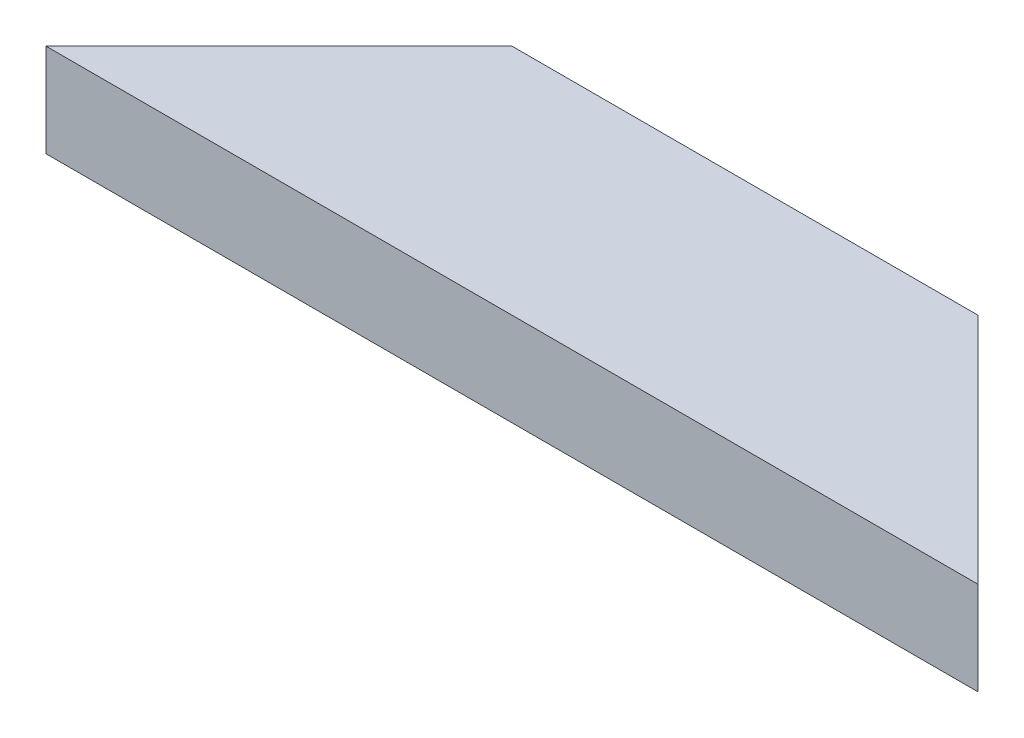
ISO-10303-21;
HEADER;
FILE_DESCRIPTION(('STEP AP214'),'2;1');
FILE_NAME('part.step','',(''),(''),'','','');
FILE_SCHEMA(('AUTOMOTIVE_DESIGN { 1 0 10303 214 1 1 1 1 }'));
ENDSEC;
DATA;
#1=APPLICATION_CONTEXT('core data for automotive mechanical design processes');
#2=APPLICATION_PROTOCOL_DEFINITION('international standard','automotive_design',2000,#1);
#3=PRODUCT_CONTEXT('',#1,'mechanical');
#4=PRODUCT('Part','Part','',(#3));
#5=PRODUCT_RELATED_PRODUCT_CATEGORY('part','',(#4));
#6=PRODUCT_DEFINITION_FORMATION('','',#4);
#7=PRODUCT_DEFINITION_CONTEXT('part definition',#1,'design');
#8=PRODUCT_DEFINITION('design','',#6,#7);
#9=PRODUCT_DEFINITION_SHAPE('','',#8);
#10=(LENGTH_UNIT() NAMED_UNIT(*) SI_UNIT(.MILLI.,.METRE.));
#11=(NAMED_UNIT(*) PLANE_ANGLE_UNIT() SI_UNIT($,.RADIAN.));
#12=(NAMED_UNIT(*) SI_UNIT($,.STERADIAN.) SOLID_ANGLE_UNIT());
#13=UNCERTAINTY_MEASURE_WITH_UNIT(LENGTH_MEASURE(1.E-05),#10,'distance_accuracy_value','');
#14=(GEOMETRIC_REPRESENTATION_CONTEXT(3) GLOBAL_UNCERTAINTY_ASSIGNED_CONTEXT((#13)) GLOBAL_UNIT_ASSIGNED_CONTEXT((#10,
#11,#12)) REPRESENTATION_CONTEXT('',''));
#15=CARTESIAN_POINT('',(0.,0.,0.));
#16=DIRECTION('',(0.,0.,1.));
#17=DIRECTION('',(1.,0.,0.));
#18=AXIS2_PLACEMENT_3D('',#15,#16,#17);
#19=CARTESIAN_POINT('',(-25.,5.,0.));
#20=DIRECTION('',(0.707106781186549,0.,0.707106781186547));
#21=DIRECTION('',(0.707106781186547,0.,-0.707106781186549));
#22=AXIS2_PLACEMENT_3D('',#19,#20,#21);
#23=PLANE('',#22);
#24=DIRECTION('',(-0.707106781186547,0.,0.707106781186549));
#25=VECTOR('',#24,1.);
#26=CARTESIAN_POINT('',(-25.,-5.,0.));
#27=LINE('',#26,#25);
#28=CARTESIAN_POINT('',(-25.,-5.,0.));
#29=VERTEX_POINT('',#28);
#30=CARTESIAN_POINT('',(-49.9999999999999,-5.,25.));
#31=VERTEX_POINT('',#30);
#32=EDGE_CURVE('E97',#29,#31,#27,.T.);
#33=ORIENTED_EDGE('',*,*,#32,.T.);
#34=DIRECTION('',(0.,-1.,0.));
#35=VECTOR('',#34,1.);
#36=CARTESIAN_POINT('',(-49.9999999999999,5.,25.));
#37=LINE('',#36,#35);
#38=CARTESIAN_POINT('',(-49.9999999999999,5.,25.));
#39=VERTEX_POINT('',#38);
#40=EDGE_CURVE('E11',#39,#31,#37,.T.);
#41=ORIENTED_EDGE('',*,*,#40,.F.);
#42=DIRECTION('',(-0.707106781186547,0.,0.707106781186549));
#43=VECTOR('',#42,1.);
#44=CARTESIAN_POINT('',(-25.,5.,0.));
#45=LINE('',#44,#43);
#46=CARTESIAN_POINT('',(-25.,5.,0.));
#47=VERTEX_POINT('',#46);
#48=EDGE_CURVE('E85',#47,#39,#45,.T.);
#49=ORIENTED_EDGE('',*,*,#48,.F.);
#50=DIRECTION('',(0.,-1.,0.));
#51=VECTOR('',#50,1.);
#52=CARTESIAN_POINT('',(-25.,5.,0.));
#53=LINE('',#52,#51);
#54=EDGE_CURVE('E93',#47,#29,#53,.T.);
#55=ORIENTED_EDGE('',*,*,#54,.T.);
#56=EDGE_LOOP('',(#33,#41,#49,#55));
#57=FACE_BOUND('',#56,.T.);
#58=ADVANCED_FACE('F34',(#57),#23,.F.);
#59=CARTESIAN_POINT('',(-49.9999999999999,5.,25.));
#60=DIRECTION('',(0.,0.,-1.));
#61=DIRECTION('',(-1.,0.,0.));
#62=AXIS2_PLACEMENT_3D('',#59,#60,#61);
#63=PLANE('',#62);
#64=DIRECTION('',(1.,0.,0.));
#65=VECTOR('',#64,1.);
#66=CARTESIAN_POINT('',(-49.9999999999999,-5.,25.));
#67=LINE('',#66,#65);
#68=CARTESIAN_POINT('',(50.0000000000003,-5.,25.));
#69=VERTEX_POINT('',#68);
#70=EDGE_CURVE('E89',#31,#69,#67,.T.);
#71=ORIENTED_EDGE('',*,*,#70,.T.);
#72=DIRECTION('',(0.,-1.,0.));
#73=VECTOR('',#72,1.);
#74=CARTESIAN_POINT('',(50.0000000000003,5.,25.));
#75=LINE('',#74,#73);
#76=CARTESIAN_POINT('',(50.0000000000003,5.,25.));
#77=VERTEX_POINT('',#76);
#78=EDGE_CURVE('E42',#77,#69,#75,.T.);
#79=ORIENTED_EDGE('',*,*,#78,.F.);
#80=DIRECTION('',(1.,0.,0.));
#81=VECTOR('',#80,1.);
#82=CARTESIAN_POINT('',(-49.9999999999999,5.,25.));
#83=LINE('',#82,#81);
#84=EDGE_CURVE('E80',#39,#77,#83,.T.);
#85=ORIENTED_EDGE('',*,*,#84,.F.);
#86=ORIENTED_EDGE('',*,*,#40,.T.);
#87=EDGE_LOOP('',(#71,#79,#85,#86));
#88=FACE_BOUND('',#87,.T.);
#89=ADVANCED_FACE('F88',(#88),#63,.F.);
#90=CARTESIAN_POINT('',(50.0000000000003,5.,25.));
#91=DIRECTION('',(-0.707106781186544,0.,0.707106781186551));
#92=DIRECTION('',(0.707106781186551,0.,0.707106781186544));
#93=AXIS2_PLACEMENT_3D('',#90,#91,#92);
#94=PLANE('',#93);
#95=DIRECTION('',(-0.707106781186551,0.,-0.707106781186544));
#96=VECTOR('',#95,1.);
#97=CARTESIAN_POINT('',(50.0000000000003,-5.,25.));
#98=LINE('',#97,#96);
#99=CARTESIAN_POINT('',(25.,-5.,0.));
#100=VERTEX_POINT('',#99);
#101=EDGE_CURVE('E67',#69,#100,#98,.T.);
#102=ORIENTED_EDGE('',*,*,#101,.T.);
#103=DIRECTION('',(0.,-1.,0.));
#104=VECTOR('',#103,1.);
#105=CARTESIAN_POINT('',(25.,5.,0.));
#106=LINE('',#105,#104);
#107=CARTESIAN_POINT('',(25.,5.,0.));
#108=VERTEX_POINT('',#107);
#109=EDGE_CURVE('E90',#108,#100,#106,.T.);
#110=ORIENTED_EDGE('',*,*,#109,.F.);
#111=DIRECTION('',(-0.707106781186551,0.,-0.707106781186544));
#112=VECTOR('',#111,1.);
#113=CARTESIAN_POINT('',(50.0000000000003,5.,25.));
#114=LINE('',#113,#112);
#115=EDGE_CURVE('E83',#77,#108,#114,.T.);
#116=ORIENTED_EDGE('',*,*,#115,.F.);
#117=ORIENTED_EDGE('',*,*,#78,.T.);
#118=EDGE_LOOP('',(#102,#110,#116,#117));
#119=FACE_BOUND('',#118,.T.);
#120=ADVANCED_FACE('F91',(#119),#94,.F.);
#121=CARTESIAN_POINT('',(25.,5.,0.));
#122=DIRECTION('',(0.,0.,1.));
#123=DIRECTION('',(1.,0.,0.));
#124=AXIS2_PLACEMENT_3D('',#121,#122,#123);
#125=PLANE('',#124);
#126=DIRECTION('',(-1.,0.,0.));
#127=VECTOR('',#126,1.);
#128=CARTESIAN_POINT('',(25.,-5.,0.));
#129=LINE('',#128,#127);
#130=EDGE_CURVE('E73',#100,#29,#129,.T.);
#131=ORIENTED_EDGE('',*,*,#130,.T.);
#132=ORIENTED_EDGE('',*,*,#54,.F.);
#133=DIRECTION('',(-1.,0.,0.));
#134=VECTOR('',#133,1.);
#135=CARTESIAN_POINT('',(25.,5.,0.));
#136=LINE('',#135,#134);
#137=EDGE_CURVE('E50',#108,#47,#136,.T.);
#138=ORIENTED_EDGE('',*,*,#137,.F.);
#139=ORIENTED_EDGE('',*,*,#109,.T.);
#140=EDGE_LOOP('',(#131,#132,#138,#139));
#141=FACE_BOUND('',#140,.T.);
#142=ADVANCED_FACE('F104',(#141),#125,.F.);
#143=CARTESIAN_POINT('',(0.,5.,0.));
#144=DIRECTION('',(0.,-1.,0.));
#145=DIRECTION('',(0.,0.,-1.));
#146=AXIS2_PLACEMENT_3D('',#143,#144,#145);
#147=PLANE('',#146);
#148=ORIENTED_EDGE('',*,*,#48,.T.);
#149=ORIENTED_EDGE('',*,*,#84,.T.);
#150=ORIENTED_EDGE('',*,*,#115,.T.);
#151=ORIENTED_EDGE('',*,*,#137,.T.);
#152=EDGE_LOOP('',(#148,#149,#150,#151));
#153=FACE_BOUND('',#152,.T.);
#154=ADVANCED_FACE('F81',(#153),#147,.F.);
#155=CARTESIAN_POINT('',(0.,-5.,0.));
#156=DIRECTION('',(0.,-1.,0.));
#157=DIRECTION('',(0.,0.,-1.));
#158=AXIS2_PLACEMENT_3D('',#155,#156,#157);
#159=PLANE('',#158);
#160=ORIENTED_EDGE('',*,*,#32,.F.);
#161=ORIENTED_EDGE('',*,*,#130,.F.);
#162=ORIENTED_EDGE('',*,*,#101,.F.);
#163=ORIENTED_EDGE('',*,*,#70,.F.);
#164=EDGE_LOOP('',(#160,#161,#162,#163));
#165=FACE_BOUND('',#164,.T.);
#166=ADVANCED_FACE('F107',(#165),#159,.T.);
#167=CLOSED_SHELL('',(#58,#89,#120,#142,#154,#166));
#168=MANIFOLD_SOLID_BREP('B2',#167);
#169=ADVANCED_BREP_SHAPE_REPRESENTATION('',(#18,#168),#14);
#170=SHAPE_DEFINITION_REPRESENTATION(#9,#169);
ENDSEC;
END-ISO-10303-21;
